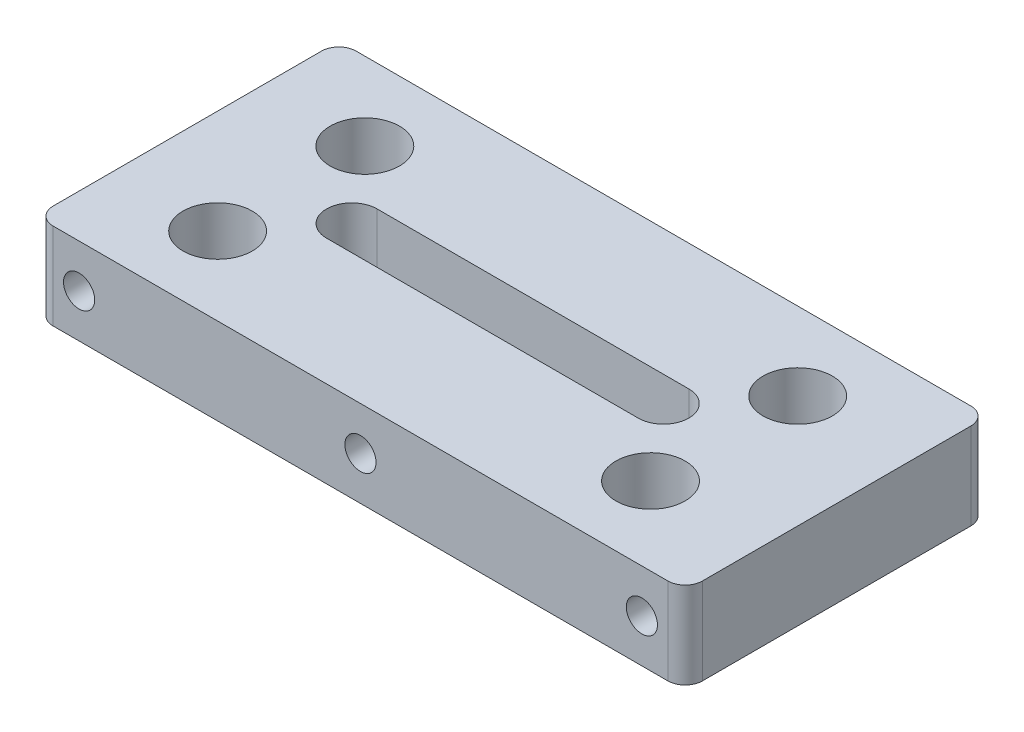
ISO-10303-21;
HEADER;
FILE_DESCRIPTION(('STEP AP214'),'2;1');
FILE_NAME('part.step','',(''),(''),'','','');
FILE_SCHEMA(('AUTOMOTIVE_DESIGN { 1 0 10303 214 1 1 1 1 }'));
ENDSEC;
DATA;
#1=APPLICATION_CONTEXT('core data for automotive mechanical design processes');
#2=APPLICATION_PROTOCOL_DEFINITION('international standard','automotive_design',2000,#1);
#3=PRODUCT_CONTEXT('',#1,'mechanical');
#4=PRODUCT('Part','Part','',(#3));
#5=PRODUCT_RELATED_PRODUCT_CATEGORY('part','',(#4));
#6=PRODUCT_DEFINITION_FORMATION('','',#4);
#7=PRODUCT_DEFINITION_CONTEXT('part definition',#1,'design');
#8=PRODUCT_DEFINITION('design','',#6,#7);
#9=PRODUCT_DEFINITION_SHAPE('','',#8);
#10=(LENGTH_UNIT() NAMED_UNIT(*) SI_UNIT(.MILLI.,.METRE.));
#11=(NAMED_UNIT(*) PLANE_ANGLE_UNIT() SI_UNIT($,.RADIAN.));
#12=(NAMED_UNIT(*) SI_UNIT($,.STERADIAN.) SOLID_ANGLE_UNIT());
#13=UNCERTAINTY_MEASURE_WITH_UNIT(LENGTH_MEASURE(1.E-05),#10,'distance_accuracy_value','');
#14=(GEOMETRIC_REPRESENTATION_CONTEXT(3) GLOBAL_UNCERTAINTY_ASSIGNED_CONTEXT((#13)) GLOBAL_UNIT_ASSIGNED_CONTEXT((#10,
#11,#12)) REPRESENTATION_CONTEXT('',''));
#15=CARTESIAN_POINT('',(0.,0.,0.));
#16=DIRECTION('',(0.,0.,1.));
#17=DIRECTION('',(1.,0.,0.));
#18=AXIS2_PLACEMENT_3D('',#15,#16,#17);
#19=CARTESIAN_POINT('',(0.,10.,0.));
#20=DIRECTION('',(1.,0.,0.));
#21=DIRECTION('',(0.,0.,-1.));
#22=AXIS2_PLACEMENT_3D('',#19,#20,#21);
#23=PLANE('',#22);
#24=DIRECTION('',(0.,0.,1.));
#25=VECTOR('',#24,1.);
#26=CARTESIAN_POINT('',(0.,10.,0.));
#27=LINE('',#26,#25);
#28=CARTESIAN_POINT('',(0.,10.,-33.));
#29=VERTEX_POINT('',#28);
#30=CARTESIAN_POINT('',(0.,10.,-2.));
#31=VERTEX_POINT('',#30);
#32=EDGE_CURVE('E214',#29,#31,#27,.T.);
#33=ORIENTED_EDGE('',*,*,#32,.F.);
#34=DIRECTION('',(0.,-1.,0.));
#35=VECTOR('',#34,1.);
#36=CARTESIAN_POINT('',(0.,10.,-33.));
#37=LINE('',#36,#35);
#38=CARTESIAN_POINT('',(0.,0.,-33.));
#39=VERTEX_POINT('',#38);
#40=EDGE_CURVE('E236',#29,#39,#37,.T.);
#41=ORIENTED_EDGE('',*,*,#40,.T.);
#42=DIRECTION('',(0.,0.,1.));
#43=VECTOR('',#42,1.);
#44=CARTESIAN_POINT('',(0.,0.,0.));
#45=LINE('',#44,#43);
#46=CARTESIAN_POINT('',(0.,0.,-2.));
#47=VERTEX_POINT('',#46);
#48=EDGE_CURVE('E199',#39,#47,#45,.T.);
#49=ORIENTED_EDGE('',*,*,#48,.T.);
#50=DIRECTION('',(0.,-1.,0.));
#51=VECTOR('',#50,1.);
#52=CARTESIAN_POINT('',(0.,10.,-2.));
#53=LINE('',#52,#51);
#54=EDGE_CURVE('E225',#47,#31,#53,.F.);
#55=ORIENTED_EDGE('',*,*,#54,.T.);
#56=EDGE_LOOP('',(#33,#41,#49,#55));
#57=FACE_BOUND('',#56,.T.);
#58=ADVANCED_FACE('F34',(#57),#23,.F.);
#59=CARTESIAN_POINT('',(0.,10.,0.));
#60=DIRECTION('',(0.,0.,-1.));
#61=DIRECTION('',(-1.,0.,0.));
#62=AXIS2_PLACEMENT_3D('',#59,#60,#61);
#63=PLANE('',#62);
#64=CARTESIAN_POINT('',(5.,5.,0.));
#65=DIRECTION('',(0.,0.,1.));
#66=DIRECTION('',(1.,0.,0.));
#67=AXIS2_PLACEMENT_3D('',#64,#65,#66);
#68=CIRCLE('',#67,1.8);
#69=CARTESIAN_POINT('',(6.8,5.,0.));
#70=VERTEX_POINT('',#69);
#71=EDGE_CURVE('E200',#70,#70,#68,.T.);
#72=ORIENTED_EDGE('',*,*,#71,.F.);
#73=EDGE_LOOP('',(#72));
#74=FACE_BOUND('',#73,.T.);
#75=CARTESIAN_POINT('',(37.5,5.,0.));
#76=DIRECTION('',(0.,0.,1.));
#77=DIRECTION('',(1.,0.,0.));
#78=AXIS2_PLACEMENT_3D('',#75,#76,#77);
#79=CIRCLE('',#78,1.8);
#80=CARTESIAN_POINT('',(39.3,5.,0.));
#81=VERTEX_POINT('',#80);
#82=EDGE_CURVE('E206',#81,#81,#79,.T.);
#83=ORIENTED_EDGE('',*,*,#82,.F.);
#84=EDGE_LOOP('',(#83));
#85=FACE_BOUND('',#84,.T.);
#86=CARTESIAN_POINT('',(70.,5.,0.));
#87=DIRECTION('',(0.,0.,1.));
#88=DIRECTION('',(1.,0.,0.));
#89=AXIS2_PLACEMENT_3D('',#86,#87,#88);
#90=CIRCLE('',#89,1.79999999999999);
#91=CARTESIAN_POINT('',(71.8,5.,0.));
#92=VERTEX_POINT('',#91);
#93=EDGE_CURVE('E181',#92,#92,#90,.T.);
#94=ORIENTED_EDGE('',*,*,#93,.F.);
#95=EDGE_LOOP('',(#94));
#96=FACE_BOUND('',#95,.T.);
#97=DIRECTION('',(1.,0.,0.));
#98=VECTOR('',#97,1.);
#99=CARTESIAN_POINT('',(0.,10.,0.));
#100=LINE('',#99,#98);
#101=CARTESIAN_POINT('',(2.,10.,0.));
#102=VERTEX_POINT('',#101);
#103=CARTESIAN_POINT('',(73.,10.,0.));
#104=VERTEX_POINT('',#103);
#105=EDGE_CURVE('E217',#102,#104,#100,.T.);
#106=ORIENTED_EDGE('',*,*,#105,.F.);
#107=DIRECTION('',(0.,-1.,0.));
#108=VECTOR('',#107,1.);
#109=CARTESIAN_POINT('',(2.,10.,0.));
#110=LINE('',#109,#108);
#111=CARTESIAN_POINT('',(2.,0.,0.));
#112=VERTEX_POINT('',#111);
#113=EDGE_CURVE('E261',#102,#112,#110,.T.);
#114=ORIENTED_EDGE('',*,*,#113,.T.);
#115=DIRECTION('',(1.,0.,0.));
#116=VECTOR('',#115,1.);
#117=CARTESIAN_POINT('',(0.,0.,0.));
#118=LINE('',#117,#116);
#119=CARTESIAN_POINT('',(73.,0.,0.));
#120=VERTEX_POINT('',#119);
#121=EDGE_CURVE('E228',#112,#120,#118,.T.);
#122=ORIENTED_EDGE('',*,*,#121,.T.);
#123=DIRECTION('',(0.,-1.,0.));
#124=VECTOR('',#123,1.);
#125=CARTESIAN_POINT('',(73.,10.,0.));
#126=LINE('',#125,#124);
#127=EDGE_CURVE('E259',#120,#104,#126,.F.);
#128=ORIENTED_EDGE('',*,*,#127,.T.);
#129=EDGE_LOOP('',(#106,#114,#122,#128));
#130=FACE_BOUND('',#129,.T.);
#131=ADVANCED_FACE('F267',(#74,#85,#96,#130),#63,.F.);
#132=CARTESIAN_POINT('',(75.,10.,0.));
#133=DIRECTION('',(-1.,0.,0.));
#134=DIRECTION('',(0.,0.,1.));
#135=AXIS2_PLACEMENT_3D('',#132,#133,#134);
#136=PLANE('',#135);
#137=DIRECTION('',(0.,0.,-1.));
#138=VECTOR('',#137,1.);
#139=CARTESIAN_POINT('',(75.,10.,0.));
#140=LINE('',#139,#138);
#141=CARTESIAN_POINT('',(75.,10.,-2.));
#142=VERTEX_POINT('',#141);
#143=CARTESIAN_POINT('',(75.,10.,-33.));
#144=VERTEX_POINT('',#143);
#145=EDGE_CURVE('E220',#142,#144,#140,.T.);
#146=ORIENTED_EDGE('',*,*,#145,.F.);
#147=DIRECTION('',(0.,-1.,0.));
#148=VECTOR('',#147,1.);
#149=CARTESIAN_POINT('',(75.,10.,-2.));
#150=LINE('',#149,#148);
#151=CARTESIAN_POINT('',(75.,0.,-2.));
#152=VERTEX_POINT('',#151);
#153=EDGE_CURVE('E11',#142,#152,#150,.T.);
#154=ORIENTED_EDGE('',*,*,#153,.T.);
#155=DIRECTION('',(0.,0.,-1.));
#156=VECTOR('',#155,1.);
#157=CARTESIAN_POINT('',(75.,0.,0.));
#158=LINE('',#157,#156);
#159=CARTESIAN_POINT('',(75.,0.,-33.));
#160=VERTEX_POINT('',#159);
#161=EDGE_CURVE('E231',#152,#160,#158,.T.);
#162=ORIENTED_EDGE('',*,*,#161,.T.);
#163=DIRECTION('',(0.,-1.,0.));
#164=VECTOR('',#163,1.);
#165=CARTESIAN_POINT('',(75.,10.,-33.));
#166=LINE('',#165,#164);
#167=EDGE_CURVE('E42',#160,#144,#166,.F.);
#168=ORIENTED_EDGE('',*,*,#167,.T.);
#169=EDGE_LOOP('',(#146,#154,#162,#168));
#170=FACE_BOUND('',#169,.T.);
#171=ADVANCED_FACE('F278',(#170),#136,.F.);
#172=CARTESIAN_POINT('',(0.,10.,-35.));
#173=DIRECTION('',(0.,0.,1.));
#174=DIRECTION('',(1.,0.,0.));
#175=AXIS2_PLACEMENT_3D('',#172,#173,#174);
#176=PLANE('',#175);
#177=CARTESIAN_POINT('',(5.,5.,-35.));
#178=DIRECTION('',(0.,0.,-1.));
#179=DIRECTION('',(-1.,0.,0.));
#180=AXIS2_PLACEMENT_3D('',#177,#178,#179);
#181=CIRCLE('',#180,1.8);
#182=CARTESIAN_POINT('',(3.2,5.,-35.));
#183=VERTEX_POINT('',#182);
#184=EDGE_CURVE('E182',#183,#183,#181,.T.);
#185=ORIENTED_EDGE('',*,*,#184,.F.);
#186=EDGE_LOOP('',(#185));
#187=FACE_BOUND('',#186,.T.);
#188=CARTESIAN_POINT('',(37.5,4.99999999999977,-35.));
#189=DIRECTION('',(0.,0.,-1.));
#190=DIRECTION('',(-1.,0.,0.));
#191=AXIS2_PLACEMENT_3D('',#188,#189,#190);
#192=CIRCLE('',#191,1.8);
#193=CARTESIAN_POINT('',(35.7,4.99999999999977,-35.));
#194=VERTEX_POINT('',#193);
#195=EDGE_CURVE('E188',#194,#194,#192,.T.);
#196=ORIENTED_EDGE('',*,*,#195,.F.);
#197=EDGE_LOOP('',(#196));
#198=FACE_BOUND('',#197,.T.);
#199=CARTESIAN_POINT('',(70.,4.99999999999955,-35.));
#200=DIRECTION('',(0.,0.,-1.));
#201=DIRECTION('',(-1.,0.,0.));
#202=AXIS2_PLACEMENT_3D('',#199,#200,#201);
#203=CIRCLE('',#202,1.79999999999999);
#204=CARTESIAN_POINT('',(68.2,4.99999999999955,-35.));
#205=VERTEX_POINT('',#204);
#206=EDGE_CURVE('E173',#205,#205,#203,.T.);
#207=ORIENTED_EDGE('',*,*,#206,.F.);
#208=EDGE_LOOP('',(#207));
#209=FACE_BOUND('',#208,.T.);
#210=DIRECTION('',(-1.,0.,0.));
#211=VECTOR('',#210,1.);
#212=CARTESIAN_POINT('',(0.,0.,-35.));
#213=LINE('',#212,#211);
#214=CARTESIAN_POINT('',(73.,0.,-35.));
#215=VERTEX_POINT('',#214);
#216=CARTESIAN_POINT('',(2.,0.,-35.));
#217=VERTEX_POINT('',#216);
#218=EDGE_CURVE('E218',#215,#217,#213,.T.);
#219=ORIENTED_EDGE('',*,*,#218,.T.);
#220=DIRECTION('',(0.,-1.,0.));
#221=VECTOR('',#220,1.);
#222=CARTESIAN_POINT('',(2.,10.,-35.));
#223=LINE('',#222,#221);
#224=CARTESIAN_POINT('',(2.,10.,-35.));
#225=VERTEX_POINT('',#224);
#226=EDGE_CURVE('E250',#217,#225,#223,.F.);
#227=ORIENTED_EDGE('',*,*,#226,.T.);
#228=DIRECTION('',(-1.,0.,0.));
#229=VECTOR('',#228,1.);
#230=CARTESIAN_POINT('',(0.,10.,-35.));
#231=LINE('',#230,#229);
#232=CARTESIAN_POINT('',(73.,10.,-35.));
#233=VERTEX_POINT('',#232);
#234=EDGE_CURVE('E222',#233,#225,#231,.T.);
#235=ORIENTED_EDGE('',*,*,#234,.F.);
#236=DIRECTION('',(0.,-1.,0.));
#237=VECTOR('',#236,1.);
#238=CARTESIAN_POINT('',(73.,10.,-35.));
#239=LINE('',#238,#237);
#240=EDGE_CURVE('E247',#233,#215,#239,.T.);
#241=ORIENTED_EDGE('',*,*,#240,.T.);
#242=EDGE_LOOP('',(#219,#227,#235,#241));
#243=FACE_BOUND('',#242,.T.);
#244=ADVANCED_FACE('F285',(#187,#198,#209,#243),#176,.F.);
#245=CARTESIAN_POINT('',(0.,10.,0.));
#246=DIRECTION('',(0.,-1.,0.));
#247=DIRECTION('',(0.,0.,-1.));
#248=AXIS2_PLACEMENT_3D('',#245,#246,#247);
#249=PLANE('',#248);
#250=DIRECTION('',(-1.,0.,0.));
#251=VECTOR('',#250,1.);
#252=CARTESIAN_POINT('',(19.,10.,-14.5767079941064));
#253=LINE('',#252,#251);
#254=CARTESIAN_POINT('',(55.,10.,-14.5767079941064));
#255=VERTEX_POINT('',#254);
#256=CARTESIAN_POINT('',(19.,10.,-14.5767079941064));
#257=VERTEX_POINT('',#256);
#258=EDGE_CURVE('E136',#255,#257,#253,.T.);
#259=ORIENTED_EDGE('',*,*,#258,.T.);
#260=CARTESIAN_POINT('',(19.,10.,-17.5));
#261=DIRECTION('',(0.,-1.,0.));
#262=DIRECTION('',(0.,0.,-1.));
#263=AXIS2_PLACEMENT_3D('',#260,#261,#262);
#264=CIRCLE('',#263,2.92329200589361);
#265=CARTESIAN_POINT('',(19.,10.,-20.4232920058936));
#266=VERTEX_POINT('',#265);
#267=EDGE_CURVE('E128',#257,#266,#264,.T.);
#268=ORIENTED_EDGE('',*,*,#267,.T.);
#269=DIRECTION('',(1.,0.,0.));
#270=VECTOR('',#269,1.);
#271=CARTESIAN_POINT('',(19.,10.,-20.4232920058936));
#272=LINE('',#271,#270);
#273=CARTESIAN_POINT('',(55.,10.,-20.4232920058936));
#274=VERTEX_POINT('',#273);
#275=EDGE_CURVE('E140',#266,#274,#272,.T.);
#276=ORIENTED_EDGE('',*,*,#275,.T.);
#277=CARTESIAN_POINT('',(55.,10.,-17.5));
#278=DIRECTION('',(0.,-1.,0.));
#279=DIRECTION('',(0.,0.,-1.));
#280=AXIS2_PLACEMENT_3D('',#277,#278,#279);
#281=CIRCLE('',#280,2.92329200589361);
#282=EDGE_CURVE('E144',#274,#255,#281,.T.);
#283=ORIENTED_EDGE('',*,*,#282,.T.);
#284=EDGE_LOOP('',(#259,#268,#276,#283));
#285=FACE_BOUND('',#284,.T.);
#286=CARTESIAN_POINT('',(12.,10.,-26.));
#287=DIRECTION('',(0.,-1.,0.));
#288=DIRECTION('',(0.,0.,1.));
#289=AXIS2_PLACEMENT_3D('',#286,#287,#288);
#290=CIRCLE('',#289,4.);
#291=CARTESIAN_POINT('',(12.,10.,-22.));
#292=VERTEX_POINT('',#291);
#293=EDGE_CURVE('E412',#292,#292,#290,.T.);
#294=ORIENTED_EDGE('',*,*,#293,.T.);
#295=EDGE_LOOP('',(#294));
#296=FACE_BOUND('',#295,.T.);
#297=CARTESIAN_POINT('',(62.,10.,-26.));
#298=DIRECTION('',(0.,-1.,0.));
#299=DIRECTION('',(0.,0.,1.));
#300=AXIS2_PLACEMENT_3D('',#297,#298,#299);
#301=CIRCLE('',#300,4.00000000000001);
#302=CARTESIAN_POINT('',(62.,10.,-22.));
#303=VERTEX_POINT('',#302);
#304=EDGE_CURVE('E404',#303,#303,#301,.T.);
#305=ORIENTED_EDGE('',*,*,#304,.T.);
#306=EDGE_LOOP('',(#305));
#307=FACE_BOUND('',#306,.T.);
#308=CARTESIAN_POINT('',(62.,10.,-9.));
#309=DIRECTION('',(0.,-1.,0.));
#310=DIRECTION('',(0.,0.,-1.));
#311=AXIS2_PLACEMENT_3D('',#308,#309,#310);
#312=CIRCLE('',#311,4.00000000000001);
#313=CARTESIAN_POINT('',(62.,10.,-13.));
#314=VERTEX_POINT('',#313);
#315=EDGE_CURVE('E177',#314,#314,#312,.T.);
#316=ORIENTED_EDGE('',*,*,#315,.T.);
#317=EDGE_LOOP('',(#316));
#318=FACE_BOUND('',#317,.T.);
#319=CARTESIAN_POINT('',(12.,10.,-9.));
#320=DIRECTION('',(0.,-1.,0.));
#321=DIRECTION('',(0.,0.,-1.));
#322=AXIS2_PLACEMENT_3D('',#319,#320,#321);
#323=CIRCLE('',#322,4.);
#324=CARTESIAN_POINT('',(12.,10.,-13.));
#325=VERTEX_POINT('',#324);
#326=EDGE_CURVE('E170',#325,#325,#323,.T.);
#327=ORIENTED_EDGE('',*,*,#326,.T.);
#328=EDGE_LOOP('',(#327));
#329=FACE_BOUND('',#328,.T.);
#330=ORIENTED_EDGE('',*,*,#234,.T.);
#331=CARTESIAN_POINT('',(2.,10.,-33.));
#332=DIRECTION('',(0.,-1.,0.));
#333=DIRECTION('',(0.,0.,-1.));
#334=AXIS2_PLACEMENT_3D('',#331,#332,#333);
#335=CIRCLE('',#334,2.);
#336=EDGE_CURVE('E257',#225,#29,#335,.F.);
#337=ORIENTED_EDGE('',*,*,#336,.T.);
#338=ORIENTED_EDGE('',*,*,#32,.T.);
#339=CARTESIAN_POINT('',(2.,10.,-2.));
#340=DIRECTION('',(0.,-1.,0.));
#341=DIRECTION('',(0.,0.,-1.));
#342=AXIS2_PLACEMENT_3D('',#339,#340,#341);
#343=CIRCLE('',#342,2.);
#344=EDGE_CURVE('E255',#31,#102,#343,.F.);
#345=ORIENTED_EDGE('',*,*,#344,.T.);
#346=ORIENTED_EDGE('',*,*,#105,.T.);
#347=CARTESIAN_POINT('',(73.,10.,-2.));
#348=DIRECTION('',(0.,-1.,0.));
#349=DIRECTION('',(0.,0.,-1.));
#350=AXIS2_PLACEMENT_3D('',#347,#348,#349);
#351=CIRCLE('',#350,2.);
#352=EDGE_CURVE('E55',#104,#142,#351,.F.);
#353=ORIENTED_EDGE('',*,*,#352,.T.);
#354=ORIENTED_EDGE('',*,*,#145,.T.);
#355=CARTESIAN_POINT('',(73.,10.,-33.));
#356=DIRECTION('',(0.,-1.,0.));
#357=DIRECTION('',(0.,0.,-1.));
#358=AXIS2_PLACEMENT_3D('',#355,#356,#357);
#359=CIRCLE('',#358,2.);
#360=EDGE_CURVE('E252',#144,#233,#359,.F.);
#361=ORIENTED_EDGE('',*,*,#360,.T.);
#362=EDGE_LOOP('',(#330,#337,#338,#345,#346,#353,#354,#361));
#363=FACE_BOUND('',#362,.T.);
#364=ADVANCED_FACE('F146',(#285,#296,#307,#318,#329,#363),#249,.F.);
#365=CARTESIAN_POINT('',(0.,0.,0.));
#366=DIRECTION('',(0.,-1.,0.));
#367=DIRECTION('',(0.,0.,-1.));
#368=AXIS2_PLACEMENT_3D('',#365,#366,#367);
#369=PLANE('',#368);
#370=CARTESIAN_POINT('',(19.,0.,-17.5));
#371=DIRECTION('',(0.,-1.,0.));
#372=DIRECTION('',(0.,0.,-1.));
#373=AXIS2_PLACEMENT_3D('',#370,#371,#372);
#374=CIRCLE('',#373,2.92329200589361);
#375=CARTESIAN_POINT('',(19.,0.,-14.5767079941064));
#376=VERTEX_POINT('',#375);
#377=CARTESIAN_POINT('',(19.,0.,-20.4232920058936));
#378=VERTEX_POINT('',#377);
#379=EDGE_CURVE('E131',#376,#378,#374,.T.);
#380=ORIENTED_EDGE('',*,*,#379,.F.);
#381=DIRECTION('',(-1.,0.,0.));
#382=VECTOR('',#381,1.);
#383=CARTESIAN_POINT('',(19.,0.,-14.5767079941064));
#384=LINE('',#383,#382);
#385=CARTESIAN_POINT('',(55.,0.,-14.5767079941064));
#386=VERTEX_POINT('',#385);
#387=EDGE_CURVE('E149',#386,#376,#384,.T.);
#388=ORIENTED_EDGE('',*,*,#387,.F.);
#389=CARTESIAN_POINT('',(55.,0.,-17.5));
#390=DIRECTION('',(0.,-1.,0.));
#391=DIRECTION('',(0.,0.,-1.));
#392=AXIS2_PLACEMENT_3D('',#389,#390,#391);
#393=CIRCLE('',#392,2.92329200589361);
#394=CARTESIAN_POINT('',(55.,0.,-20.4232920058936));
#395=VERTEX_POINT('',#394);
#396=EDGE_CURVE('E152',#395,#386,#393,.T.);
#397=ORIENTED_EDGE('',*,*,#396,.F.);
#398=DIRECTION('',(1.,0.,0.));
#399=VECTOR('',#398,1.);
#400=CARTESIAN_POINT('',(19.,0.,-20.4232920058936));
#401=LINE('',#400,#399);
#402=EDGE_CURVE('E161',#378,#395,#401,.T.);
#403=ORIENTED_EDGE('',*,*,#402,.F.);
#404=EDGE_LOOP('',(#380,#388,#397,#403));
#405=FACE_BOUND('',#404,.T.);
#406=CARTESIAN_POINT('',(12.,0.,-26.));
#407=DIRECTION('',(0.,-1.,0.));
#408=DIRECTION('',(0.,0.,1.));
#409=AXIS2_PLACEMENT_3D('',#406,#407,#408);
#410=CIRCLE('',#409,4.);
#411=CARTESIAN_POINT('',(12.,0.,-22.));
#412=VERTEX_POINT('',#411);
#413=EDGE_CURVE('E155',#412,#412,#410,.T.);
#414=ORIENTED_EDGE('',*,*,#413,.F.);
#415=EDGE_LOOP('',(#414));
#416=FACE_BOUND('',#415,.T.);
#417=CARTESIAN_POINT('',(62.,0.,-26.));
#418=DIRECTION('',(0.,-1.,0.));
#419=DIRECTION('',(0.,0.,1.));
#420=AXIS2_PLACEMENT_3D('',#417,#418,#419);
#421=CIRCLE('',#420,4.00000000000001);
#422=CARTESIAN_POINT('',(62.,0.,-22.));
#423=VERTEX_POINT('',#422);
#424=EDGE_CURVE('E408',#423,#423,#421,.T.);
#425=ORIENTED_EDGE('',*,*,#424,.F.);
#426=EDGE_LOOP('',(#425));
#427=FACE_BOUND('',#426,.T.);
#428=CARTESIAN_POINT('',(62.,0.,-9.));
#429=DIRECTION('',(0.,-1.,0.));
#430=DIRECTION('',(0.,0.,-1.));
#431=AXIS2_PLACEMENT_3D('',#428,#429,#430);
#432=CIRCLE('',#431,4.00000000000001);
#433=CARTESIAN_POINT('',(62.,0.,-13.));
#434=VERTEX_POINT('',#433);
#435=EDGE_CURVE('E402',#434,#434,#432,.T.);
#436=ORIENTED_EDGE('',*,*,#435,.F.);
#437=EDGE_LOOP('',(#436));
#438=FACE_BOUND('',#437,.T.);
#439=CARTESIAN_POINT('',(12.,0.,-9.));
#440=DIRECTION('',(0.,-1.,0.));
#441=DIRECTION('',(0.,0.,-1.));
#442=AXIS2_PLACEMENT_3D('',#439,#440,#441);
#443=CIRCLE('',#442,4.);
#444=CARTESIAN_POINT('',(12.,0.,-13.));
#445=VERTEX_POINT('',#444);
#446=EDGE_CURVE('E174',#445,#445,#443,.T.);
#447=ORIENTED_EDGE('',*,*,#446,.F.);
#448=EDGE_LOOP('',(#447));
#449=FACE_BOUND('',#448,.T.);
#450=ORIENTED_EDGE('',*,*,#48,.F.);
#451=CARTESIAN_POINT('',(2.,0.,-33.));
#452=DIRECTION('',(0.,-1.,0.));
#453=DIRECTION('',(0.,0.,-1.));
#454=AXIS2_PLACEMENT_3D('',#451,#452,#453);
#455=CIRCLE('',#454,2.);
#456=EDGE_CURVE('E245',#39,#217,#455,.T.);
#457=ORIENTED_EDGE('',*,*,#456,.T.);
#458=ORIENTED_EDGE('',*,*,#218,.F.);
#459=CARTESIAN_POINT('',(73.,0.,-33.));
#460=DIRECTION('',(0.,-1.,0.));
#461=DIRECTION('',(0.,0.,-1.));
#462=AXIS2_PLACEMENT_3D('',#459,#460,#461);
#463=CIRCLE('',#462,2.);
#464=EDGE_CURVE('E239',#215,#160,#463,.T.);
#465=ORIENTED_EDGE('',*,*,#464,.T.);
#466=ORIENTED_EDGE('',*,*,#161,.F.);
#467=CARTESIAN_POINT('',(73.,0.,-2.));
#468=DIRECTION('',(0.,-1.,0.));
#469=DIRECTION('',(0.,0.,-1.));
#470=AXIS2_PLACEMENT_3D('',#467,#468,#469);
#471=CIRCLE('',#470,2.);
#472=EDGE_CURVE('E241',#152,#120,#471,.T.);
#473=ORIENTED_EDGE('',*,*,#472,.T.);
#474=ORIENTED_EDGE('',*,*,#121,.F.);
#475=CARTESIAN_POINT('',(2.,0.,-2.));
#476=DIRECTION('',(0.,-1.,0.));
#477=DIRECTION('',(0.,0.,-1.));
#478=AXIS2_PLACEMENT_3D('',#475,#476,#477);
#479=CIRCLE('',#478,2.);
#480=EDGE_CURVE('E243',#112,#47,#479,.T.);
#481=ORIENTED_EDGE('',*,*,#480,.T.);
#482=EDGE_LOOP('',(#450,#457,#458,#465,#466,#473,#474,#481));
#483=FACE_BOUND('',#482,.T.);
#484=ADVANCED_FACE('F273',(#405,#416,#427,#438,#449,#483),#369,.T.);
#485=CARTESIAN_POINT('',(70.,5.,-10.));
#486=DIRECTION('',(0.,0.,1.));
#487=DIRECTION('',(1.,0.,0.));
#488=AXIS2_PLACEMENT_3D('',#485,#486,#487);
#489=CYLINDRICAL_SURFACE('',#488,1.79999999999999);
#490=CARTESIAN_POINT('',(70.,5.,-10.));
#491=DIRECTION('',(0.,0.,1.));
#492=DIRECTION('',(1.,0.,0.));
#493=AXIS2_PLACEMENT_3D('',#490,#491,#492);
#494=CIRCLE('',#493,1.79999999999999);
#495=CARTESIAN_POINT('',(71.8,5.,-10.));
#496=VERTEX_POINT('',#495);
#497=EDGE_CURVE('E209',#496,#496,#494,.T.);
#498=ORIENTED_EDGE('',*,*,#497,.F.);
#499=EDGE_LOOP('',(#498));
#500=FACE_BOUND('',#499,.T.);
#501=ORIENTED_EDGE('',*,*,#93,.T.);
#502=EDGE_LOOP('',(#501));
#503=FACE_BOUND('',#502,.T.);
#504=ADVANCED_FACE('F317',(#500,#503),#489,.F.);
#505=CARTESIAN_POINT('',(70.,5.,-10.));
#506=DIRECTION('',(0.,0.,1.));
#507=DIRECTION('',(1.,0.,0.));
#508=AXIS2_PLACEMENT_3D('',#505,#506,#507);
#509=PLANE('',#508);
#510=ORIENTED_EDGE('',*,*,#497,.T.);
#511=EDGE_LOOP('',(#510));
#512=FACE_BOUND('',#511,.T.);
#513=ADVANCED_FACE('F323',(#512),#509,.T.);
#514=CARTESIAN_POINT('',(37.5,5.,-10.));
#515=DIRECTION('',(0.,0.,1.));
#516=DIRECTION('',(1.,0.,0.));
#517=AXIS2_PLACEMENT_3D('',#514,#515,#516);
#518=CYLINDRICAL_SURFACE('',#517,1.8);
#519=CARTESIAN_POINT('',(37.5,5.,-10.));
#520=DIRECTION('',(0.,0.,1.));
#521=DIRECTION('',(1.,0.,0.));
#522=AXIS2_PLACEMENT_3D('',#519,#520,#521);
#523=CIRCLE('',#522,1.8);
#524=CARTESIAN_POINT('',(39.3,5.,-10.));
#525=VERTEX_POINT('',#524);
#526=EDGE_CURVE('E203',#525,#525,#523,.T.);
#527=ORIENTED_EDGE('',*,*,#526,.F.);
#528=EDGE_LOOP('',(#527));
#529=FACE_BOUND('',#528,.T.);
#530=ORIENTED_EDGE('',*,*,#82,.T.);
#531=EDGE_LOOP('',(#530));
#532=FACE_BOUND('',#531,.T.);
#533=ADVANCED_FACE('F327',(#529,#532),#518,.F.);
#534=CARTESIAN_POINT('',(37.5,5.,-10.));
#535=DIRECTION('',(0.,0.,1.));
#536=DIRECTION('',(1.,0.,0.));
#537=AXIS2_PLACEMENT_3D('',#534,#535,#536);
#538=PLANE('',#537);
#539=ORIENTED_EDGE('',*,*,#526,.T.);
#540=EDGE_LOOP('',(#539));
#541=FACE_BOUND('',#540,.T.);
#542=ADVANCED_FACE('F331',(#541),#538,.T.);
#543=CARTESIAN_POINT('',(5.,5.,-10.));
#544=DIRECTION('',(0.,0.,1.));
#545=DIRECTION('',(1.,0.,0.));
#546=AXIS2_PLACEMENT_3D('',#543,#544,#545);
#547=CYLINDRICAL_SURFACE('',#546,1.8);
#548=CARTESIAN_POINT('',(5.,5.,-10.));
#549=DIRECTION('',(0.,0.,1.));
#550=DIRECTION('',(1.,0.,0.));
#551=AXIS2_PLACEMENT_3D('',#548,#549,#550);
#552=CIRCLE('',#551,1.8);
#553=CARTESIAN_POINT('',(6.8,5.,-10.));
#554=VERTEX_POINT('',#553);
#555=EDGE_CURVE('E196',#554,#554,#552,.T.);
#556=ORIENTED_EDGE('',*,*,#555,.F.);
#557=EDGE_LOOP('',(#556));
#558=FACE_BOUND('',#557,.T.);
#559=ORIENTED_EDGE('',*,*,#71,.T.);
#560=EDGE_LOOP('',(#559));
#561=FACE_BOUND('',#560,.T.);
#562=ADVANCED_FACE('F335',(#558,#561),#547,.F.);
#563=CARTESIAN_POINT('',(5.,5.,-10.));
#564=DIRECTION('',(0.,0.,1.));
#565=DIRECTION('',(1.,0.,0.));
#566=AXIS2_PLACEMENT_3D('',#563,#564,#565);
#567=PLANE('',#566);
#568=ORIENTED_EDGE('',*,*,#555,.T.);
#569=EDGE_LOOP('',(#568));
#570=FACE_BOUND('',#569,.T.);
#571=ADVANCED_FACE('F339',(#570),#567,.T.);
#572=CARTESIAN_POINT('',(70.,4.99999999999955,-25.));
#573=DIRECTION('',(0.,0.,-1.));
#574=DIRECTION('',(-1.,0.,0.));
#575=AXIS2_PLACEMENT_3D('',#572,#573,#574);
#576=CYLINDRICAL_SURFACE('',#575,1.79999999999999);
#577=CARTESIAN_POINT('',(70.,4.99999999999955,-25.));
#578=DIRECTION('',(0.,0.,-1.));
#579=DIRECTION('',(-1.,0.,0.));
#580=AXIS2_PLACEMENT_3D('',#577,#578,#579);
#581=CIRCLE('',#580,1.79999999999999);
#582=CARTESIAN_POINT('',(68.2,4.99999999999955,-25.));
#583=VERTEX_POINT('',#582);
#584=EDGE_CURVE('E191',#583,#583,#581,.T.);
#585=ORIENTED_EDGE('',*,*,#584,.F.);
#586=EDGE_LOOP('',(#585));
#587=FACE_BOUND('',#586,.T.);
#588=ORIENTED_EDGE('',*,*,#206,.T.);
#589=EDGE_LOOP('',(#588));
#590=FACE_BOUND('',#589,.T.);
#591=ADVANCED_FACE('F343',(#587,#590),#576,.F.);
#592=CARTESIAN_POINT('',(70.,4.99999999999955,-25.));
#593=DIRECTION('',(0.,0.,-1.));
#594=DIRECTION('',(-1.,0.,0.));
#595=AXIS2_PLACEMENT_3D('',#592,#593,#594);
#596=PLANE('',#595);
#597=ORIENTED_EDGE('',*,*,#584,.T.);
#598=EDGE_LOOP('',(#597));
#599=FACE_BOUND('',#598,.T.);
#600=ADVANCED_FACE('F347',(#599),#596,.T.);
#601=CARTESIAN_POINT('',(37.5,4.99999999999977,-25.));
#602=DIRECTION('',(0.,0.,-1.));
#603=DIRECTION('',(-1.,0.,0.));
#604=AXIS2_PLACEMENT_3D('',#601,#602,#603);
#605=CYLINDRICAL_SURFACE('',#604,1.8);
#606=CARTESIAN_POINT('',(37.5,4.99999999999977,-25.));
#607=DIRECTION('',(0.,0.,-1.));
#608=DIRECTION('',(-1.,0.,0.));
#609=AXIS2_PLACEMENT_3D('',#606,#607,#608);
#610=CIRCLE('',#609,1.8);
#611=CARTESIAN_POINT('',(35.7,4.99999999999977,-25.));
#612=VERTEX_POINT('',#611);
#613=EDGE_CURVE('E185',#612,#612,#610,.T.);
#614=ORIENTED_EDGE('',*,*,#613,.F.);
#615=EDGE_LOOP('',(#614));
#616=FACE_BOUND('',#615,.T.);
#617=ORIENTED_EDGE('',*,*,#195,.T.);
#618=EDGE_LOOP('',(#617));
#619=FACE_BOUND('',#618,.T.);
#620=ADVANCED_FACE('F351',(#616,#619),#605,.F.);
#621=CARTESIAN_POINT('',(37.5,4.99999999999977,-25.));
#622=DIRECTION('',(0.,0.,-1.));
#623=DIRECTION('',(-1.,0.,0.));
#624=AXIS2_PLACEMENT_3D('',#621,#622,#623);
#625=PLANE('',#624);
#626=ORIENTED_EDGE('',*,*,#613,.T.);
#627=EDGE_LOOP('',(#626));
#628=FACE_BOUND('',#627,.T.);
#629=ADVANCED_FACE('F355',(#628),#625,.T.);
#630=CARTESIAN_POINT('',(5.,5.,-25.));
#631=DIRECTION('',(0.,0.,-1.));
#632=DIRECTION('',(-1.,0.,0.));
#633=AXIS2_PLACEMENT_3D('',#630,#631,#632);
#634=CYLINDRICAL_SURFACE('',#633,1.8);
#635=CARTESIAN_POINT('',(5.,5.,-25.));
#636=DIRECTION('',(0.,0.,-1.));
#637=DIRECTION('',(-1.,0.,0.));
#638=AXIS2_PLACEMENT_3D('',#635,#636,#637);
#639=CIRCLE('',#638,1.8);
#640=CARTESIAN_POINT('',(3.2,5.,-25.));
#641=VERTEX_POINT('',#640);
#642=EDGE_CURVE('E178',#641,#641,#639,.T.);
#643=ORIENTED_EDGE('',*,*,#642,.F.);
#644=EDGE_LOOP('',(#643));
#645=FACE_BOUND('',#644,.T.);
#646=ORIENTED_EDGE('',*,*,#184,.T.);
#647=EDGE_LOOP('',(#646));
#648=FACE_BOUND('',#647,.T.);
#649=ADVANCED_FACE('F359',(#645,#648),#634,.F.);
#650=CARTESIAN_POINT('',(5.,5.,-25.));
#651=DIRECTION('',(0.,0.,-1.));
#652=DIRECTION('',(-1.,0.,0.));
#653=AXIS2_PLACEMENT_3D('',#650,#651,#652);
#654=PLANE('',#653);
#655=ORIENTED_EDGE('',*,*,#642,.T.);
#656=EDGE_LOOP('',(#655));
#657=FACE_BOUND('',#656,.T.);
#658=ADVANCED_FACE('F363',(#657),#654,.T.);
#659=CARTESIAN_POINT('',(12.,10.,-9.));
#660=DIRECTION('',(0.,-1.,0.));
#661=DIRECTION('',(0.,0.,-1.));
#662=AXIS2_PLACEMENT_3D('',#659,#660,#661);
#663=CYLINDRICAL_SURFACE('',#662,4.);
#664=ORIENTED_EDGE('',*,*,#326,.F.);
#665=EDGE_LOOP('',(#664));
#666=FACE_BOUND('',#665,.T.);
#667=ORIENTED_EDGE('',*,*,#446,.T.);
#668=EDGE_LOOP('',(#667));
#669=FACE_BOUND('',#668,.T.);
#670=ADVANCED_FACE('F367',(#666,#669),#663,.F.);
#671=CARTESIAN_POINT('',(62.,10.,-9.));
#672=DIRECTION('',(0.,-1.,0.));
#673=DIRECTION('',(0.,0.,-1.));
#674=AXIS2_PLACEMENT_3D('',#671,#672,#673);
#675=CYLINDRICAL_SURFACE('',#674,4.00000000000001);
#676=ORIENTED_EDGE('',*,*,#315,.F.);
#677=EDGE_LOOP('',(#676));
#678=FACE_BOUND('',#677,.T.);
#679=ORIENTED_EDGE('',*,*,#435,.T.);
#680=EDGE_LOOP('',(#679));
#681=FACE_BOUND('',#680,.T.);
#682=ADVANCED_FACE('F371',(#678,#681),#675,.F.);
#683=CARTESIAN_POINT('',(62.,10.,-26.));
#684=DIRECTION('',(0.,-1.,0.));
#685=DIRECTION('',(0.,0.,-1.));
#686=AXIS2_PLACEMENT_3D('',#683,#684,#685);
#687=CYLINDRICAL_SURFACE('',#686,4.00000000000001);
#688=ORIENTED_EDGE('',*,*,#304,.F.);
#689=EDGE_LOOP('',(#688));
#690=FACE_BOUND('',#689,.T.);
#691=ORIENTED_EDGE('',*,*,#424,.T.);
#692=EDGE_LOOP('',(#691));
#693=FACE_BOUND('',#692,.T.);
#694=ADVANCED_FACE('F388',(#690,#693),#687,.F.);
#695=CARTESIAN_POINT('',(12.,10.,-26.));
#696=DIRECTION('',(0.,-1.,0.));
#697=DIRECTION('',(0.,0.,-1.));
#698=AXIS2_PLACEMENT_3D('',#695,#696,#697);
#699=CYLINDRICAL_SURFACE('',#698,4.);
#700=ORIENTED_EDGE('',*,*,#293,.F.);
#701=EDGE_LOOP('',(#700));
#702=FACE_BOUND('',#701,.T.);
#703=ORIENTED_EDGE('',*,*,#413,.T.);
#704=EDGE_LOOP('',(#703));
#705=FACE_BOUND('',#704,.T.);
#706=ADVANCED_FACE('F376',(#702,#705),#699,.F.);
#707=CARTESIAN_POINT('',(19.,10.,-17.5));
#708=DIRECTION('',(0.,-1.,0.));
#709=DIRECTION('',(0.,0.,-1.));
#710=AXIS2_PLACEMENT_3D('',#707,#708,#709);
#711=CYLINDRICAL_SURFACE('',#710,2.92329200589361);
#712=ORIENTED_EDGE('',*,*,#379,.T.);
#713=DIRECTION('',(0.,-1.,0.));
#714=VECTOR('',#713,1.);
#715=CARTESIAN_POINT('',(19.,10.,-20.4232920058936));
#716=LINE('',#715,#714);
#717=EDGE_CURVE('E124',#266,#378,#716,.T.);
#718=ORIENTED_EDGE('',*,*,#717,.F.);
#719=ORIENTED_EDGE('',*,*,#267,.F.);
#720=DIRECTION('',(0.,-1.,0.));
#721=VECTOR('',#720,1.);
#722=CARTESIAN_POINT('',(19.,10.,-14.5767079941064));
#723=LINE('',#722,#721);
#724=EDGE_CURVE('E165',#257,#376,#723,.T.);
#725=ORIENTED_EDGE('',*,*,#724,.T.);
#726=EDGE_LOOP('',(#712,#718,#719,#725));
#727=FACE_BOUND('',#726,.T.);
#728=ADVANCED_FACE('F126',(#727),#711,.F.);
#729=CARTESIAN_POINT('',(19.,10.,-14.5767079941064));
#730=DIRECTION('',(0.,0.,1.));
#731=DIRECTION('',(1.,0.,0.));
#732=AXIS2_PLACEMENT_3D('',#729,#730,#731);
#733=PLANE('',#732);
#734=ORIENTED_EDGE('',*,*,#387,.T.);
#735=ORIENTED_EDGE('',*,*,#724,.F.);
#736=ORIENTED_EDGE('',*,*,#258,.F.);
#737=DIRECTION('',(0.,-1.,0.));
#738=VECTOR('',#737,1.);
#739=CARTESIAN_POINT('',(55.,10.,-14.5767079941064));
#740=LINE('',#739,#738);
#741=EDGE_CURVE('E167',#255,#386,#740,.T.);
#742=ORIENTED_EDGE('',*,*,#741,.T.);
#743=EDGE_LOOP('',(#734,#735,#736,#742));
#744=FACE_BOUND('',#743,.T.);
#745=ADVANCED_FACE('F375',(#744),#733,.F.);
#746=CARTESIAN_POINT('',(55.,10.,-17.5));
#747=DIRECTION('',(0.,-1.,0.));
#748=DIRECTION('',(0.,0.,-1.));
#749=AXIS2_PLACEMENT_3D('',#746,#747,#748);
#750=CYLINDRICAL_SURFACE('',#749,2.92329200589361);
#751=ORIENTED_EDGE('',*,*,#396,.T.);
#752=ORIENTED_EDGE('',*,*,#741,.F.);
#753=ORIENTED_EDGE('',*,*,#282,.F.);
#754=DIRECTION('',(0.,-1.,0.));
#755=VECTOR('',#754,1.);
#756=CARTESIAN_POINT('',(55.,10.,-20.4232920058936));
#757=LINE('',#756,#755);
#758=EDGE_CURVE('E135',#274,#395,#757,.T.);
#759=ORIENTED_EDGE('',*,*,#758,.T.);
#760=EDGE_LOOP('',(#751,#752,#753,#759));
#761=FACE_BOUND('',#760,.T.);
#762=ADVANCED_FACE('F379',(#761),#750,.F.);
#763=CARTESIAN_POINT('',(19.,10.,-20.4232920058936));
#764=DIRECTION('',(0.,0.,-1.));
#765=DIRECTION('',(-1.,0.,0.));
#766=AXIS2_PLACEMENT_3D('',#763,#764,#765);
#767=PLANE('',#766);
#768=ORIENTED_EDGE('',*,*,#402,.T.);
#769=ORIENTED_EDGE('',*,*,#758,.F.);
#770=ORIENTED_EDGE('',*,*,#275,.F.);
#771=ORIENTED_EDGE('',*,*,#717,.T.);
#772=EDGE_LOOP('',(#768,#769,#770,#771));
#773=FACE_BOUND('',#772,.T.);
#774=ADVANCED_FACE('F141',(#773),#767,.F.);
#775=CARTESIAN_POINT('',(2.,10.,-33.));
#776=DIRECTION('',(0.,-1.,0.));
#777=DIRECTION('',(0.,0.,-1.));
#778=AXIS2_PLACEMENT_3D('',#775,#776,#777);
#779=CYLINDRICAL_SURFACE('',#778,2.);
#780=ORIENTED_EDGE('',*,*,#336,.F.);
#781=ORIENTED_EDGE('',*,*,#226,.F.);
#782=ORIENTED_EDGE('',*,*,#456,.F.);
#783=ORIENTED_EDGE('',*,*,#40,.F.);
#784=EDGE_LOOP('',(#780,#781,#782,#783));
#785=FACE_BOUND('',#784,.T.);
#786=ADVANCED_FACE('F290',(#785),#779,.T.);
#787=CARTESIAN_POINT('',(2.,10.,-2.));
#788=DIRECTION('',(0.,-1.,0.));
#789=DIRECTION('',(0.,0.,-1.));
#790=AXIS2_PLACEMENT_3D('',#787,#788,#789);
#791=CYLINDRICAL_SURFACE('',#790,2.);
#792=ORIENTED_EDGE('',*,*,#344,.F.);
#793=ORIENTED_EDGE('',*,*,#54,.F.);
#794=ORIENTED_EDGE('',*,*,#480,.F.);
#795=ORIENTED_EDGE('',*,*,#113,.F.);
#796=EDGE_LOOP('',(#792,#793,#794,#795));
#797=FACE_BOUND('',#796,.T.);
#798=ADVANCED_FACE('F294',(#797),#791,.T.);
#799=CARTESIAN_POINT('',(73.,10.,-2.));
#800=DIRECTION('',(0.,-1.,0.));
#801=DIRECTION('',(0.,0.,-1.));
#802=AXIS2_PLACEMENT_3D('',#799,#800,#801);
#803=CYLINDRICAL_SURFACE('',#802,2.);
#804=ORIENTED_EDGE('',*,*,#352,.F.);
#805=ORIENTED_EDGE('',*,*,#127,.F.);
#806=ORIENTED_EDGE('',*,*,#472,.F.);
#807=ORIENTED_EDGE('',*,*,#153,.F.);
#808=EDGE_LOOP('',(#804,#805,#806,#807));
#809=FACE_BOUND('',#808,.T.);
#810=ADVANCED_FACE('F277',(#809),#803,.T.);
#811=CARTESIAN_POINT('',(73.,10.,-33.));
#812=DIRECTION('',(0.,-1.,0.));
#813=DIRECTION('',(0.,0.,-1.));
#814=AXIS2_PLACEMENT_3D('',#811,#812,#813);
#815=CYLINDRICAL_SURFACE('',#814,2.);
#816=ORIENTED_EDGE('',*,*,#360,.F.);
#817=ORIENTED_EDGE('',*,*,#167,.F.);
#818=ORIENTED_EDGE('',*,*,#464,.F.);
#819=ORIENTED_EDGE('',*,*,#240,.F.);
#820=EDGE_LOOP('',(#816,#817,#818,#819));
#821=FACE_BOUND('',#820,.T.);
#822=ADVANCED_FACE('F36',(#821),#815,.T.);
#823=CLOSED_SHELL('',(#58,#131,#171,#244,#364,#484,#504,#513,#533,#542,#562,#571,#591,#600,#620,
#629,#649,#658,#670,#682,#694,#706,#728,#745,#762,#774,#786,#798,#810,#822));
#824=MANIFOLD_SOLID_BREP('B2',#823);
#825=ADVANCED_BREP_SHAPE_REPRESENTATION('',(#18,#824),#14);
#826=SHAPE_DEFINITION_REPRESENTATION(#9,#825);
ENDSEC;
END-ISO-10303-21;
